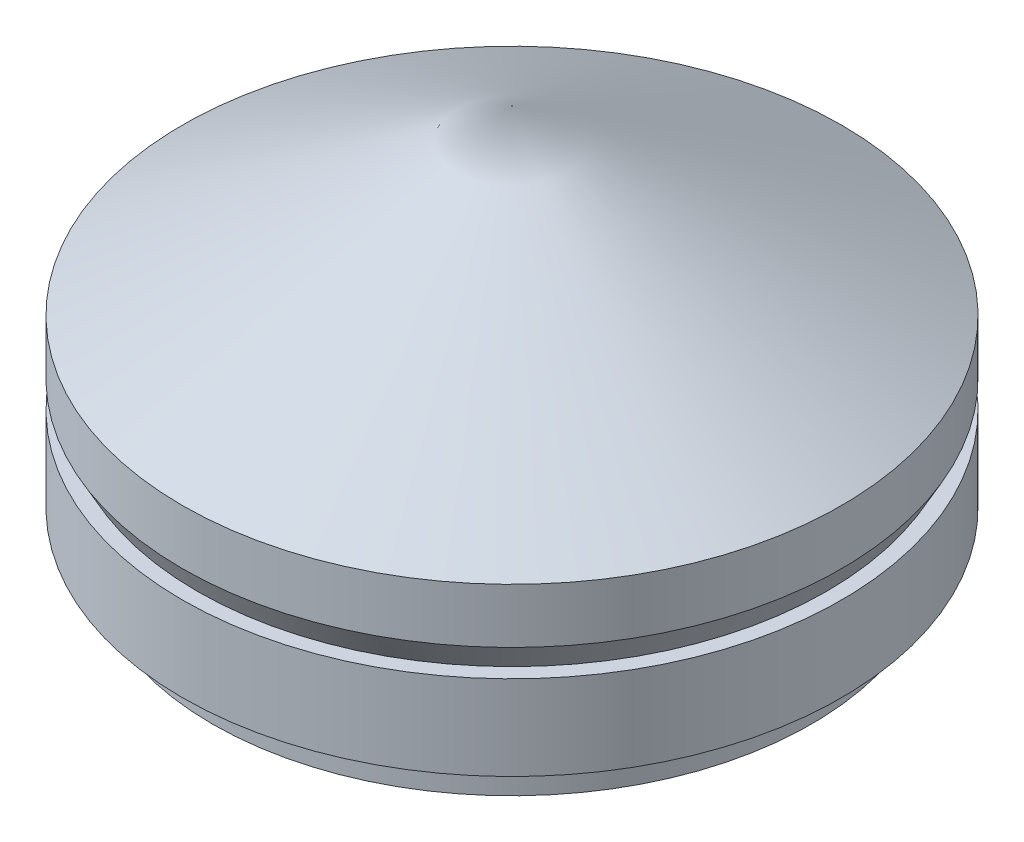
ISO-10303-21;
HEADER;
FILE_DESCRIPTION(('STEP AP214'),'2;1');
FILE_NAME('part.step','',(''),(''),'','','');
FILE_SCHEMA(('AUTOMOTIVE_DESIGN { 1 0 10303 214 1 1 1 1 }'));
ENDSEC;
DATA;
#1=APPLICATION_CONTEXT('core data for automotive mechanical design processes');
#2=APPLICATION_PROTOCOL_DEFINITION('international standard','automotive_design',2000,#1);
#3=PRODUCT_CONTEXT('',#1,'mechanical');
#4=PRODUCT('Part','Part','',(#3));
#5=PRODUCT_RELATED_PRODUCT_CATEGORY('part','',(#4));
#6=PRODUCT_DEFINITION_FORMATION('','',#4);
#7=PRODUCT_DEFINITION_CONTEXT('part definition',#1,'design');
#8=PRODUCT_DEFINITION('design','',#6,#7);
#9=PRODUCT_DEFINITION_SHAPE('','',#8);
#10=(LENGTH_UNIT() NAMED_UNIT(*) SI_UNIT(.MILLI.,.METRE.));
#11=(NAMED_UNIT(*) PLANE_ANGLE_UNIT() SI_UNIT($,.RADIAN.));
#12=(NAMED_UNIT(*) SI_UNIT($,.STERADIAN.) SOLID_ANGLE_UNIT());
#13=UNCERTAINTY_MEASURE_WITH_UNIT(LENGTH_MEASURE(1.E-05),#10,'distance_accuracy_value','');
#14=(GEOMETRIC_REPRESENTATION_CONTEXT(3) GLOBAL_UNCERTAINTY_ASSIGNED_CONTEXT((#13)) GLOBAL_UNIT_ASSIGNED_CONTEXT((#10,
#11,#12)) REPRESENTATION_CONTEXT('',''));
#15=CARTESIAN_POINT('',(0.,0.,0.));
#16=DIRECTION('',(0.,0.,1.));
#17=DIRECTION('',(1.,0.,0.));
#18=AXIS2_PLACEMENT_3D('',#15,#16,#17);
#19=CARTESIAN_POINT('',(0.,55.1340653535556,0.));
#20=DIRECTION('',(0.,-1.,0.));
#21=DIRECTION('',(0.,0.,-1.));
#22=AXIS2_PLACEMENT_3D('',#19,#20,#21);
#23=CONICAL_SURFACE('',#22,0.,1.06795311586703);
#24=CARTESIAN_POINT('',(0.,51.7928153535556,0.));
#25=DIRECTION('',(0.,1.,0.));
#26=DIRECTION('',(0.,0.,1.));
#27=AXIS2_PLACEMENT_3D('',#24,#25,#26);
#28=CIRCLE('',#27,6.075);
#29=CARTESIAN_POINT('',(0.,51.7928153535556,6.075));
#30=VERTEX_POINT('',#29);
#31=EDGE_CURVE('E11',#30,#30,#28,.T.);
#32=ORIENTED_EDGE('',*,*,#31,.T.);
#33=EDGE_LOOP('',(#32));
#34=FACE_BOUND('',#33,.T.);
#35=CARTESIAN_POINT('',(0.,55.1340653535556,0.));
#36=VERTEX_POINT('',#35);
#37=VERTEX_LOOP('',#36);
#38=FACE_BOUND('',#37,.T.);
#39=ADVANCED_FACE('F33',(#34,#38),#23,.T.);
#40=CARTESIAN_POINT('',(0.,55.1340653535556,0.));
#41=DIRECTION('',(0.,1.,0.));
#42=DIRECTION('',(0.,0.,1.));
#43=AXIS2_PLACEMENT_3D('',#40,#41,#42);
#44=CYLINDRICAL_SURFACE('',#43,6.075);
#45=CARTESIAN_POINT('',(0.,50.7848365218624,0.));
#46=DIRECTION('',(0.,1.,0.));
#47=DIRECTION('',(0.,0.,1.));
#48=AXIS2_PLACEMENT_3D('',#45,#46,#47);
#49=CIRCLE('',#48,6.075);
#50=CARTESIAN_POINT('',(0.,50.7848365218624,6.075));
#51=VERTEX_POINT('',#50);
#52=EDGE_CURVE('E39',#51,#51,#49,.T.);
#53=ORIENTED_EDGE('',*,*,#52,.T.);
#54=EDGE_LOOP('',(#53));
#55=FACE_BOUND('',#54,.T.);
#56=ORIENTED_EDGE('',*,*,#31,.F.);
#57=EDGE_LOOP('',(#56));
#58=FACE_BOUND('',#57,.T.);
#59=ADVANCED_FACE('F43',(#55,#58),#44,.T.);
#60=CARTESIAN_POINT('',(0.,50.7848365218624,0.));
#61=DIRECTION('',(0.,1.,0.));
#62=DIRECTION('',(0.,0.,1.));
#63=AXIS2_PLACEMENT_3D('',#60,#61,#62);
#64=CONICAL_SURFACE('',#63,6.075,0.502843210927862);
#65=CARTESIAN_POINT('',(0.,50.2848365218624,0.));
#66=DIRECTION('',(0.,1.,0.));
#67=DIRECTION('',(0.,0.,1.));
#68=AXIS2_PLACEMENT_3D('',#65,#66,#67);
#69=CIRCLE('',#68,5.8);
#70=CARTESIAN_POINT('',(0.,50.2848365218624,5.8));
#71=VERTEX_POINT('',#70);
#72=EDGE_CURVE('E94',#71,#71,#69,.T.);
#73=ORIENTED_EDGE('',*,*,#72,.T.);
#74=EDGE_LOOP('',(#73));
#75=FACE_BOUND('',#74,.T.);
#76=ORIENTED_EDGE('',*,*,#52,.F.);
#77=EDGE_LOOP('',(#76));
#78=FACE_BOUND('',#77,.T.);
#79=ADVANCED_FACE('F48',(#75,#78),#64,.T.);
#80=CARTESIAN_POINT('',(-5.8,50.2848365218624,0.));
#81=DIRECTION('',(0.,1.,0.));
#82=DIRECTION('',(0.,0.,1.));
#83=AXIS2_PLACEMENT_3D('',#80,#81,#82);
#84=PLANE('',#83);
#85=CARTESIAN_POINT('',(0.,50.2848365218624,0.));
#86=DIRECTION('',(0.,1.,0.));
#87=DIRECTION('',(0.,0.,1.));
#88=AXIS2_PLACEMENT_3D('',#85,#86,#87);
#89=CIRCLE('',#88,6.075);
#90=CARTESIAN_POINT('',(0.,50.2848365218624,6.075));
#91=VERTEX_POINT('',#90);
#92=EDGE_CURVE('E87',#91,#91,#89,.T.);
#93=ORIENTED_EDGE('',*,*,#92,.T.);
#94=EDGE_LOOP('',(#93));
#95=FACE_BOUND('',#94,.T.);
#96=ORIENTED_EDGE('',*,*,#72,.F.);
#97=EDGE_LOOP('',(#96));
#98=FACE_BOUND('',#97,.T.);
#99=ADVANCED_FACE('F55',(#95,#98),#84,.T.);
#100=CARTESIAN_POINT('',(0.,55.1340653535556,0.));
#101=DIRECTION('',(0.,1.,0.));
#102=DIRECTION('',(0.,0.,1.));
#103=AXIS2_PLACEMENT_3D('',#100,#101,#102);
#104=CYLINDRICAL_SURFACE('',#103,6.075);
#105=CARTESIAN_POINT('',(0.,48.7248365218624,0.));
#106=DIRECTION('',(0.,1.,0.));
#107=DIRECTION('',(0.,0.,1.));
#108=AXIS2_PLACEMENT_3D('',#105,#106,#107);
#109=CIRCLE('',#108,6.075);
#110=CARTESIAN_POINT('',(0.,48.7248365218624,6.075));
#111=VERTEX_POINT('',#110);
#112=EDGE_CURVE('E83',#111,#111,#109,.T.);
#113=ORIENTED_EDGE('',*,*,#112,.T.);
#114=EDGE_LOOP('',(#113));
#115=FACE_BOUND('',#114,.T.);
#116=ORIENTED_EDGE('',*,*,#92,.F.);
#117=EDGE_LOOP('',(#116));
#118=FACE_BOUND('',#117,.T.);
#119=ADVANCED_FACE('F62',(#115,#118),#104,.T.);
#120=CARTESIAN_POINT('',(-6.075,48.7248365218624,0.));
#121=DIRECTION('',(0.,-1.,0.));
#122=DIRECTION('',(0.,0.,-1.));
#123=AXIS2_PLACEMENT_3D('',#120,#121,#122);
#124=PLANE('',#123);
#125=CARTESIAN_POINT('',(0.,48.7248365218624,0.));
#126=DIRECTION('',(0.,-1.,0.));
#127=DIRECTION('',(0.,0.,-1.));
#128=AXIS2_PLACEMENT_3D('',#125,#126,#127);
#129=CIRCLE('',#128,5.52);
#130=CARTESIAN_POINT('',(0.,48.7248365218624,-5.52));
#131=VERTEX_POINT('',#130);
#132=EDGE_CURVE('E84',#131,#131,#129,.T.);
#133=ORIENTED_EDGE('',*,*,#132,.F.);
#134=EDGE_LOOP('',(#133));
#135=FACE_BOUND('',#134,.T.);
#136=ORIENTED_EDGE('',*,*,#112,.F.);
#137=EDGE_LOOP('',(#136));
#138=FACE_BOUND('',#137,.T.);
#139=ADVANCED_FACE('F66',(#135,#138),#124,.T.);
#140=CARTESIAN_POINT('',(0.,48.0248365218624,0.));
#141=DIRECTION('',(0.,1.,0.));
#142=DIRECTION('',(0.,0.,1.));
#143=AXIS2_PLACEMENT_3D('',#140,#141,#142);
#144=CYLINDRICAL_SURFACE('',#143,5.52);
#145=CARTESIAN_POINT('',(0.,48.0248365218624,0.));
#146=DIRECTION('',(0.,-1.,0.));
#147=DIRECTION('',(0.,0.,-1.));
#148=AXIS2_PLACEMENT_3D('',#145,#146,#147);
#149=CIRCLE('',#148,5.52);
#150=CARTESIAN_POINT('',(0.,48.0248365218624,-5.52));
#151=VERTEX_POINT('',#150);
#152=EDGE_CURVE('E82',#151,#151,#149,.T.);
#153=ORIENTED_EDGE('',*,*,#152,.F.);
#154=EDGE_LOOP('',(#153));
#155=FACE_BOUND('',#154,.T.);
#156=ORIENTED_EDGE('',*,*,#132,.T.);
#157=EDGE_LOOP('',(#156));
#158=FACE_BOUND('',#157,.T.);
#159=ADVANCED_FACE('F70',(#155,#158),#144,.T.);
#160=CARTESIAN_POINT('',(0.,48.0248365218624,0.));
#161=DIRECTION('',(0.,-1.,0.));
#162=DIRECTION('',(0.,0.,-1.));
#163=AXIS2_PLACEMENT_3D('',#160,#161,#162);
#164=PLANE('',#163);
#165=ORIENTED_EDGE('',*,*,#152,.T.);
#166=EDGE_LOOP('',(#165));
#167=FACE_BOUND('',#166,.T.);
#168=ADVANCED_FACE('F74',(#167),#164,.T.);
#169=CLOSED_SHELL('',(#39,#59,#79,#99,#119,#139,#159,#168));
#170=MANIFOLD_SOLID_BREP('B2',#169);
#171=ADVANCED_BREP_SHAPE_REPRESENTATION('',(#18,#170),#14);
#172=SHAPE_DEFINITION_REPRESENTATION(#9,#171);
ENDSEC;
END-ISO-10303-21;
